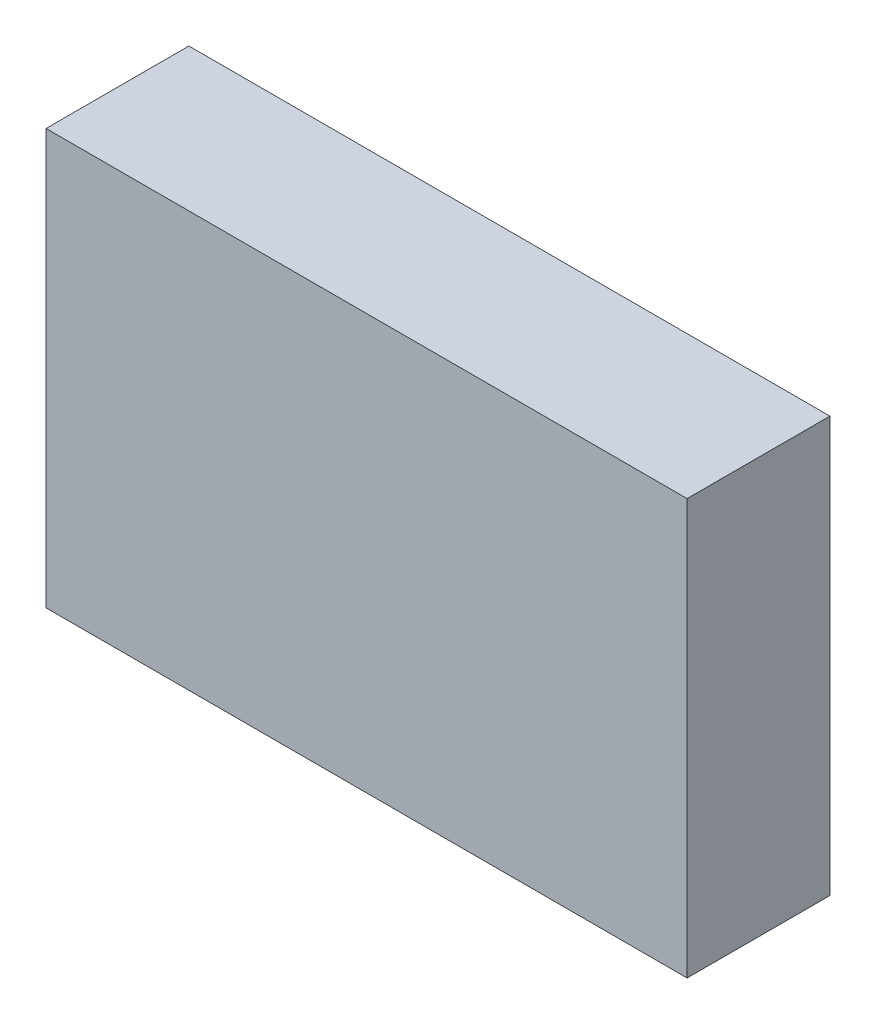
ISO-10303-21;
HEADER;
FILE_DESCRIPTION(('STEP AP214'),'2;1');
FILE_NAME('part.step','',(''),(''),'','','');
FILE_SCHEMA(('AUTOMOTIVE_DESIGN { 1 0 10303 214 1 1 1 1 }'));
ENDSEC;
DATA;
#1=APPLICATION_CONTEXT('core data for automotive mechanical design processes');
#2=APPLICATION_PROTOCOL_DEFINITION('international standard','automotive_design',2000,#1);
#3=PRODUCT_CONTEXT('',#1,'mechanical');
#4=PRODUCT('Part','Part','',(#3));
#5=PRODUCT_RELATED_PRODUCT_CATEGORY('part','',(#4));
#6=PRODUCT_DEFINITION_FORMATION('','',#4);
#7=PRODUCT_DEFINITION_CONTEXT('part definition',#1,'design');
#8=PRODUCT_DEFINITION('design','',#6,#7);
#9=PRODUCT_DEFINITION_SHAPE('','',#8);
#10=(LENGTH_UNIT() NAMED_UNIT(*) SI_UNIT(.MILLI.,.METRE.));
#11=(NAMED_UNIT(*) PLANE_ANGLE_UNIT() SI_UNIT($,.RADIAN.));
#12=(NAMED_UNIT(*) SI_UNIT($,.STERADIAN.) SOLID_ANGLE_UNIT());
#13=UNCERTAINTY_MEASURE_WITH_UNIT(LENGTH_MEASURE(1.E-05),#10,'distance_accuracy_value','');
#14=(GEOMETRIC_REPRESENTATION_CONTEXT(3) GLOBAL_UNCERTAINTY_ASSIGNED_CONTEXT((#13)) GLOBAL_UNIT_ASSIGNED_CONTEXT((#10,
#11,#12)) REPRESENTATION_CONTEXT('',''));
#15=CARTESIAN_POINT('',(0.,0.,0.));
#16=DIRECTION('',(0.,0.,1.));
#17=DIRECTION('',(1.,0.,0.));
#18=AXIS2_PLACEMENT_3D('',#15,#16,#17);
#19=CARTESIAN_POINT('',(0.,0.,0.465));
#20=DIRECTION('',(0.,0.,-1.));
#21=DIRECTION('',(-1.,0.,0.));
#22=AXIS2_PLACEMENT_3D('',#19,#20,#21);
#23=PLANE('',#22);
#24=DIRECTION('',(1.,0.,0.));
#25=VECTOR('',#24,1.);
#26=CARTESIAN_POINT('',(0.965,-0.625,0.465));
#27=LINE('',#26,#25);
#28=CARTESIAN_POINT('',(0.965,-0.625,0.465));
#29=VERTEX_POINT('',#28);
#30=CARTESIAN_POINT('',(-0.965,-0.625,0.465));
#31=VERTEX_POINT('',#30);
#32=EDGE_CURVE('E69',#29,#31,#27,.F.);
#33=ORIENTED_EDGE('',*,*,#32,.F.);
#34=DIRECTION('',(0.,1.,0.));
#35=VECTOR('',#34,1.);
#36=CARTESIAN_POINT('',(0.965,0.625,0.465));
#37=LINE('',#36,#35);
#38=CARTESIAN_POINT('',(0.965,0.625,0.465));
#39=VERTEX_POINT('',#38);
#40=EDGE_CURVE('E56',#39,#29,#37,.F.);
#41=ORIENTED_EDGE('',*,*,#40,.F.);
#42=DIRECTION('',(1.,0.,0.));
#43=VECTOR('',#42,1.);
#44=CARTESIAN_POINT('',(-0.965,0.625,0.465));
#45=LINE('',#44,#43);
#46=CARTESIAN_POINT('',(-0.965,0.625,0.465));
#47=VERTEX_POINT('',#46);
#48=EDGE_CURVE('E62',#47,#39,#45,.T.);
#49=ORIENTED_EDGE('',*,*,#48,.F.);
#50=DIRECTION('',(0.,1.,0.));
#51=VECTOR('',#50,1.);
#52=CARTESIAN_POINT('',(-0.965,0.,0.465));
#53=LINE('',#52,#51);
#54=EDGE_CURVE('E20',#31,#47,#53,.T.);
#55=ORIENTED_EDGE('',*,*,#54,.F.);
#56=EDGE_LOOP('',(#33,#41,#49,#55));
#57=FACE_BOUND('',#56,.T.);
#58=ADVANCED_FACE('F17',(#57),#23,.F.);
#59=CARTESIAN_POINT('',(-0.965,0.625,0.035));
#60=DIRECTION('',(0.,1.,0.));
#61=DIRECTION('',(0.,0.,1.));
#62=AXIS2_PLACEMENT_3D('',#59,#60,#61);
#63=PLANE('',#62);
#64=DIRECTION('',(0.,0.,-1.));
#65=VECTOR('',#64,1.);
#66=CARTESIAN_POINT('',(0.965,0.625,0.035));
#67=LINE('',#66,#65);
#68=CARTESIAN_POINT('',(0.965,0.625,0.035));
#69=VERTEX_POINT('',#68);
#70=EDGE_CURVE('E64',#69,#39,#67,.F.);
#71=ORIENTED_EDGE('',*,*,#70,.F.);
#72=DIRECTION('',(-1.,0.,0.));
#73=VECTOR('',#72,1.);
#74=CARTESIAN_POINT('',(0.,0.625,0.035));
#75=LINE('',#74,#73);
#76=CARTESIAN_POINT('',(-0.965,0.625,0.035));
#77=VERTEX_POINT('',#76);
#78=EDGE_CURVE('E83',#77,#69,#75,.F.);
#79=ORIENTED_EDGE('',*,*,#78,.F.);
#80=DIRECTION('',(0.,0.,1.));
#81=VECTOR('',#80,1.);
#82=CARTESIAN_POINT('',(-0.965,0.625,0.035));
#83=LINE('',#82,#81);
#84=EDGE_CURVE('E67',#47,#77,#83,.F.);
#85=ORIENTED_EDGE('',*,*,#84,.F.);
#86=ORIENTED_EDGE('',*,*,#48,.T.);
#87=EDGE_LOOP('',(#71,#79,#85,#86));
#88=FACE_BOUND('',#87,.T.);
#89=ADVANCED_FACE('F63',(#88),#63,.T.);
#90=CARTESIAN_POINT('',(0.965,0.625,0.035));
#91=DIRECTION('',(1.,0.,0.));
#92=DIRECTION('',(0.,0.,-1.));
#93=AXIS2_PLACEMENT_3D('',#90,#91,#92);
#94=PLANE('',#93);
#95=DIRECTION('',(0.,0.,-1.));
#96=VECTOR('',#95,1.);
#97=CARTESIAN_POINT('',(0.965,-0.625,0.035));
#98=LINE('',#97,#96);
#99=CARTESIAN_POINT('',(0.965,-0.625,0.035));
#100=VERTEX_POINT('',#99);
#101=EDGE_CURVE('E71',#100,#29,#98,.F.);
#102=ORIENTED_EDGE('',*,*,#101,.F.);
#103=DIRECTION('',(0.,1.,0.));
#104=VECTOR('',#103,1.);
#105=CARTESIAN_POINT('',(0.965,0.,0.035));
#106=LINE('',#105,#104);
#107=EDGE_CURVE('E75',#69,#100,#106,.F.);
#108=ORIENTED_EDGE('',*,*,#107,.F.);
#109=ORIENTED_EDGE('',*,*,#70,.T.);
#110=ORIENTED_EDGE('',*,*,#40,.T.);
#111=EDGE_LOOP('',(#102,#108,#109,#110));
#112=FACE_BOUND('',#111,.T.);
#113=ADVANCED_FACE('F73',(#112),#94,.T.);
#114=CARTESIAN_POINT('',(0.965,-0.625,0.035));
#115=DIRECTION('',(0.,-1.,0.));
#116=DIRECTION('',(0.,0.,-1.));
#117=AXIS2_PLACEMENT_3D('',#114,#115,#116);
#118=PLANE('',#117);
#119=DIRECTION('',(0.,0.,1.));
#120=VECTOR('',#119,1.);
#121=CARTESIAN_POINT('',(-0.965,-0.625,0.035));
#122=LINE('',#121,#120);
#123=CARTESIAN_POINT('',(-0.965,-0.625,0.035));
#124=VERTEX_POINT('',#123);
#125=EDGE_CURVE('E35',#124,#31,#122,.T.);
#126=ORIENTED_EDGE('',*,*,#125,.F.);
#127=DIRECTION('',(-1.,0.,0.));
#128=VECTOR('',#127,1.);
#129=CARTESIAN_POINT('',(0.,-0.625,0.035));
#130=LINE('',#129,#128);
#131=EDGE_CURVE('E26',#100,#124,#130,.T.);
#132=ORIENTED_EDGE('',*,*,#131,.F.);
#133=ORIENTED_EDGE('',*,*,#101,.T.);
#134=ORIENTED_EDGE('',*,*,#32,.T.);
#135=EDGE_LOOP('',(#126,#132,#133,#134));
#136=FACE_BOUND('',#135,.T.);
#137=ADVANCED_FACE('F89',(#136),#118,.T.);
#138=CARTESIAN_POINT('',(-0.965,-0.625,0.035));
#139=DIRECTION('',(-1.,0.,0.));
#140=DIRECTION('',(0.,0.,1.));
#141=AXIS2_PLACEMENT_3D('',#138,#139,#140);
#142=PLANE('',#141);
#143=ORIENTED_EDGE('',*,*,#84,.T.);
#144=DIRECTION('',(0.,1.,0.));
#145=VECTOR('',#144,1.);
#146=CARTESIAN_POINT('',(-0.965,0.,0.035));
#147=LINE('',#146,#145);
#148=EDGE_CURVE('E11',#124,#77,#147,.T.);
#149=ORIENTED_EDGE('',*,*,#148,.F.);
#150=ORIENTED_EDGE('',*,*,#125,.T.);
#151=ORIENTED_EDGE('',*,*,#54,.T.);
#152=EDGE_LOOP('',(#143,#149,#150,#151));
#153=FACE_BOUND('',#152,.T.);
#154=ADVANCED_FACE('F91',(#153),#142,.T.);
#155=CARTESIAN_POINT('',(0.,0.,0.035));
#156=DIRECTION('',(0.,0.,-1.));
#157=DIRECTION('',(-1.,0.,0.));
#158=AXIS2_PLACEMENT_3D('',#155,#156,#157);
#159=PLANE('',#158);
#160=ORIENTED_EDGE('',*,*,#131,.T.);
#161=ORIENTED_EDGE('',*,*,#148,.T.);
#162=ORIENTED_EDGE('',*,*,#78,.T.);
#163=ORIENTED_EDGE('',*,*,#107,.T.);
#164=EDGE_LOOP('',(#160,#161,#162,#163));
#165=FACE_BOUND('',#164,.T.);
#166=ADVANCED_FACE('F88',(#165),#159,.T.);
#167=CLOSED_SHELL('',(#58,#89,#113,#137,#154,#166));
#168=MANIFOLD_SOLID_BREP('B1',#167);
#169=ADVANCED_BREP_SHAPE_REPRESENTATION('',(#18,#168),#14);
#170=SHAPE_DEFINITION_REPRESENTATION(#9,#169);
ENDSEC;
END-ISO-10303-21;
